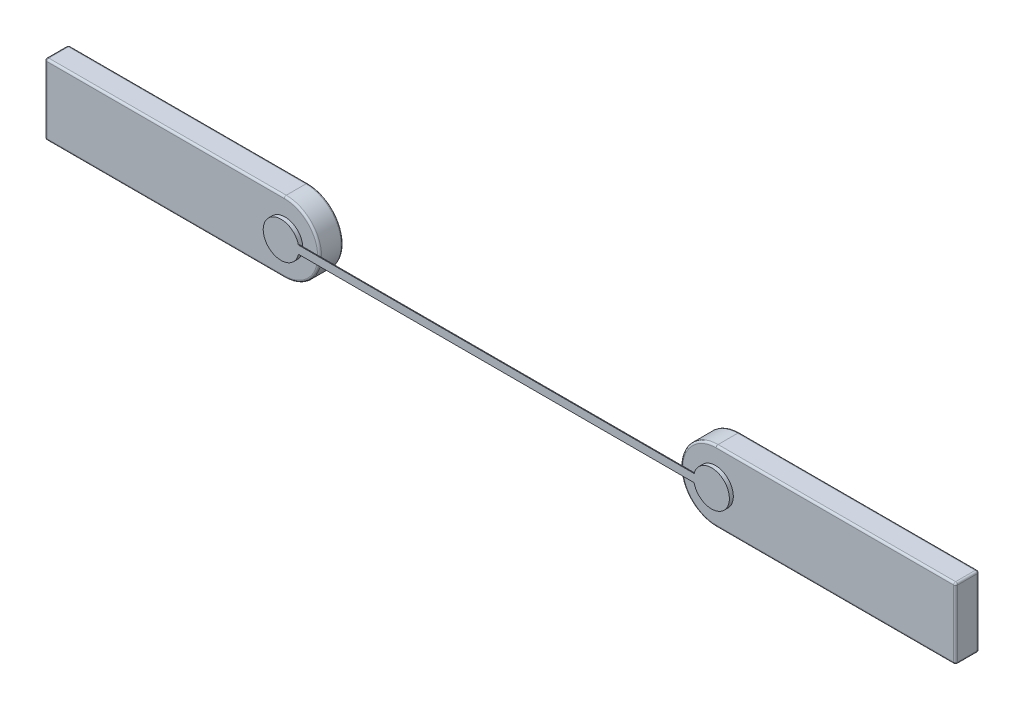
ISO-10303-21;
HEADER;
FILE_DESCRIPTION(('STEP AP214'),'2;1');
FILE_NAME('part.step','',(''),(''),'','','');
FILE_SCHEMA(('AUTOMOTIVE_DESIGN { 1 0 10303 214 1 1 1 1 }'));
ENDSEC;
DATA;
#1=APPLICATION_CONTEXT('core data for automotive mechanical design processes');
#2=APPLICATION_PROTOCOL_DEFINITION('international standard','automotive_design',2000,#1);
#3=PRODUCT_CONTEXT('',#1,'mechanical');
#4=PRODUCT('Part','Part','',(#3));
#5=PRODUCT_RELATED_PRODUCT_CATEGORY('part','',(#4));
#6=PRODUCT_DEFINITION_FORMATION('','',#4);
#7=PRODUCT_DEFINITION_CONTEXT('part definition',#1,'design');
#8=PRODUCT_DEFINITION('design','',#6,#7);
#9=PRODUCT_DEFINITION_SHAPE('','',#8);
#10=(LENGTH_UNIT() NAMED_UNIT(*) SI_UNIT(.MILLI.,.METRE.));
#11=(NAMED_UNIT(*) PLANE_ANGLE_UNIT() SI_UNIT($,.RADIAN.));
#12=(NAMED_UNIT(*) SI_UNIT($,.STERADIAN.) SOLID_ANGLE_UNIT());
#13=UNCERTAINTY_MEASURE_WITH_UNIT(LENGTH_MEASURE(1.E-05),#10,'distance_accuracy_value','');
#14=(GEOMETRIC_REPRESENTATION_CONTEXT(3) GLOBAL_UNCERTAINTY_ASSIGNED_CONTEXT((#13)) GLOBAL_UNIT_ASSIGNED_CONTEXT((#10,
#11,#12)) REPRESENTATION_CONTEXT('',''));
#15=CARTESIAN_POINT('',(0.,0.,0.));
#16=DIRECTION('',(0.,0.,1.));
#17=DIRECTION('',(1.,0.,0.));
#18=AXIS2_PLACEMENT_3D('',#15,#16,#17);
#19=CARTESIAN_POINT('',(-5.775,0.425,0.025));
#20=DIRECTION('',(1.,0.,0.));
#21=DIRECTION('',(0.,0.,-1.));
#22=AXIS2_PLACEMENT_3D('',#19,#20,#21);
#23=SPHERICAL_SURFACE('',#22,0.0249999999999995);
#24=CARTESIAN_POINT('',(-5.775,0.425,0.025));
#25=DIRECTION('',(-1.,0.,0.));
#26=DIRECTION('',(0.,-1.,0.));
#27=AXIS2_PLACEMENT_3D('',#24,#25,#26);
#28=CIRCLE('',#27,0.025);
#29=CARTESIAN_POINT('',(-5.775,0.425,0.));
#30=VERTEX_POINT('',#29);
#31=CARTESIAN_POINT('',(-5.775,0.45,0.025));
#32=VERTEX_POINT('',#31);
#33=EDGE_CURVE('E109',#30,#32,#28,.F.);
#34=ORIENTED_EDGE('',*,*,#33,.F.);
#35=CARTESIAN_POINT('',(-5.775,0.425,0.025));
#36=DIRECTION('',(0.,-1.,0.));
#37=DIRECTION('',(0.,0.,-1.));
#38=AXIS2_PLACEMENT_3D('',#35,#36,#37);
#39=CIRCLE('',#38,0.025);
#40=CARTESIAN_POINT('',(-5.8,0.425,0.025));
#41=VERTEX_POINT('',#40);
#42=EDGE_CURVE('E113',#41,#30,#39,.T.);
#43=ORIENTED_EDGE('',*,*,#42,.F.);
#44=CARTESIAN_POINT('',(-5.775,0.425,0.025));
#45=DIRECTION('',(0.,0.,-1.));
#46=DIRECTION('',(-1.,0.,0.));
#47=AXIS2_PLACEMENT_3D('',#44,#45,#46);
#48=CIRCLE('',#47,0.025);
#49=EDGE_CURVE('E137',#32,#41,#48,.F.);
#50=ORIENTED_EDGE('',*,*,#49,.F.);
#51=EDGE_LOOP('',(#34,#43,#50));
#52=FACE_BOUND('',#51,.T.);
#53=ADVANCED_FACE('F17',(#52),#23,.T.);
#54=CARTESIAN_POINT('',(-5.775,-0.425,0.025));
#55=DIRECTION('',(1.,0.,0.));
#56=DIRECTION('',(0.,-1.,0.));
#57=AXIS2_PLACEMENT_3D('',#54,#55,#56);
#58=SPHERICAL_SURFACE('',#57,0.0249999999999995);
#59=CARTESIAN_POINT('',(-5.775,-0.425,0.025));
#60=DIRECTION('',(0.,-1.,0.));
#61=DIRECTION('',(0.,0.,-1.));
#62=AXIS2_PLACEMENT_3D('',#59,#60,#61);
#63=CIRCLE('',#62,0.025);
#64=CARTESIAN_POINT('',(-5.775,-0.425,0.));
#65=VERTEX_POINT('',#64);
#66=CARTESIAN_POINT('',(-5.8,-0.425,0.025));
#67=VERTEX_POINT('',#66);
#68=EDGE_CURVE('E124',#65,#67,#63,.F.);
#69=ORIENTED_EDGE('',*,*,#68,.F.);
#70=CARTESIAN_POINT('',(-5.775,-0.425,0.025));
#71=DIRECTION('',(1.,0.,0.));
#72=DIRECTION('',(0.,1.,0.));
#73=AXIS2_PLACEMENT_3D('',#70,#71,#72);
#74=CIRCLE('',#73,0.025);
#75=CARTESIAN_POINT('',(-5.775,-0.45,0.025));
#76=VERTEX_POINT('',#75);
#77=EDGE_CURVE('E157',#76,#65,#74,.T.);
#78=ORIENTED_EDGE('',*,*,#77,.F.);
#79=CARTESIAN_POINT('',(-5.775,-0.425,0.025));
#80=DIRECTION('',(0.,0.,-1.));
#81=DIRECTION('',(-1.,0.,0.));
#82=AXIS2_PLACEMENT_3D('',#79,#80,#81);
#83=CIRCLE('',#82,0.025);
#84=EDGE_CURVE('E305',#67,#76,#83,.F.);
#85=ORIENTED_EDGE('',*,*,#84,.F.);
#86=EDGE_LOOP('',(#69,#78,#85));
#87=FACE_BOUND('',#86,.T.);
#88=ADVANCED_FACE('F746',(#87),#58,.T.);
#89=CARTESIAN_POINT('',(-4.138488794369,0.,0.));
#90=DIRECTION('',(0.,0.,1.));
#91=DIRECTION('',(1.,0.,0.));
#92=AXIS2_PLACEMENT_3D('',#89,#90,#91);
#93=PLANE('',#92);
#94=CARTESIAN_POINT('',(-2.75,0.,0.));
#95=DIRECTION('',(0.,0.,1.));
#96=DIRECTION('',(1.,0.,0.));
#97=AXIS2_PLACEMENT_3D('',#94,#95,#96);
#98=CIRCLE('',#97,0.425);
#99=CARTESIAN_POINT('',(-2.75,-0.425,0.));
#100=VERTEX_POINT('',#99);
#101=CARTESIAN_POINT('',(-2.75,0.425,0.));
#102=VERTEX_POINT('',#101);
#103=EDGE_CURVE('E21',#100,#102,#98,.T.);
#104=ORIENTED_EDGE('',*,*,#103,.F.);
#105=DIRECTION('',(1.,0.,0.));
#106=VECTOR('',#105,1.);
#107=CARTESIAN_POINT('',(-4.206744397185,-0.425,0.));
#108=LINE('',#107,#106);
#109=EDGE_CURVE('E120',#65,#100,#108,.T.);
#110=ORIENTED_EDGE('',*,*,#109,.F.);
#111=DIRECTION('',(0.,-1.,0.));
#112=VECTOR('',#111,1.);
#113=CARTESIAN_POINT('',(-5.775,0.,0.));
#114=LINE('',#113,#112);
#115=EDGE_CURVE('E116',#30,#65,#114,.T.);
#116=ORIENTED_EDGE('',*,*,#115,.F.);
#117=DIRECTION('',(-1.,0.,0.));
#118=VECTOR('',#117,1.);
#119=CARTESIAN_POINT('',(-4.206744397185,0.425,0.));
#120=LINE('',#119,#118);
#121=EDGE_CURVE('E103',#102,#30,#120,.T.);
#122=ORIENTED_EDGE('',*,*,#121,.F.);
#123=EDGE_LOOP('',(#104,#110,#116,#122));
#124=FACE_BOUND('',#123,.T.);
#125=ADVANCED_FACE('F118',(#124),#93,.F.);
#126=CARTESIAN_POINT('',(-2.75,0.,0.025));
#127=DIRECTION('',(0.,0.,1.));
#128=DIRECTION('',(1.,0.,0.));
#129=AXIS2_PLACEMENT_3D('',#126,#127,#128);
#130=TOROIDAL_SURFACE('',#129,0.425,0.025);
#131=ORIENTED_EDGE('',*,*,#103,.T.);
#132=CARTESIAN_POINT('',(-2.75,0.425,0.025));
#133=DIRECTION('',(-1.,0.,0.));
#134=DIRECTION('',(0.,-1.,0.));
#135=AXIS2_PLACEMENT_3D('',#132,#133,#134);
#136=CIRCLE('',#135,0.025);
#137=CARTESIAN_POINT('',(-2.75,0.45,0.025));
#138=VERTEX_POINT('',#137);
#139=EDGE_CURVE('E111',#138,#102,#136,.T.);
#140=ORIENTED_EDGE('',*,*,#139,.F.);
#141=CARTESIAN_POINT('',(-2.75,0.,0.025));
#142=DIRECTION('',(0.,0.,-1.));
#143=DIRECTION('',(-1.,0.,0.));
#144=AXIS2_PLACEMENT_3D('',#141,#142,#143);
#145=CIRCLE('',#144,0.45);
#146=CARTESIAN_POINT('',(-2.75,-0.45,0.025));
#147=VERTEX_POINT('',#146);
#148=EDGE_CURVE('E149',#147,#138,#145,.F.);
#149=ORIENTED_EDGE('',*,*,#148,.F.);
#150=CARTESIAN_POINT('',(-2.75,-0.425,0.025));
#151=DIRECTION('',(1.,0.,0.));
#152=DIRECTION('',(0.,1.,0.));
#153=AXIS2_PLACEMENT_3D('',#150,#151,#152);
#154=CIRCLE('',#153,0.025);
#155=EDGE_CURVE('E153',#100,#147,#154,.F.);
#156=ORIENTED_EDGE('',*,*,#155,.F.);
#157=EDGE_LOOP('',(#131,#140,#149,#156));
#158=FACE_BOUND('',#157,.T.);
#159=ADVANCED_FACE('F743',(#158),#130,.T.);
#160=CARTESIAN_POINT('',(-4.206744397185,0.425,0.025));
#161=DIRECTION('',(-1.,0.,0.));
#162=DIRECTION('',(0.,-1.,0.));
#163=AXIS2_PLACEMENT_3D('',#160,#161,#162);
#164=CYLINDRICAL_SURFACE('',#163,0.025);
#165=ORIENTED_EDGE('',*,*,#139,.T.);
#166=ORIENTED_EDGE('',*,*,#121,.T.);
#167=ORIENTED_EDGE('',*,*,#33,.T.);
#168=DIRECTION('',(-1.,0.,0.));
#169=VECTOR('',#168,1.);
#170=CARTESIAN_POINT('',(-4.275,0.45,0.025));
#171=LINE('',#170,#169);
#172=EDGE_CURVE('E285',#138,#32,#171,.T.);
#173=ORIENTED_EDGE('',*,*,#172,.F.);
#174=EDGE_LOOP('',(#165,#166,#167,#173));
#175=FACE_BOUND('',#174,.T.);
#176=ADVANCED_FACE('F105',(#175),#164,.T.);
#177=CARTESIAN_POINT('',(-5.775,0.,0.025));
#178=DIRECTION('',(0.,-1.,0.));
#179=DIRECTION('',(0.,0.,-1.));
#180=AXIS2_PLACEMENT_3D('',#177,#178,#179);
#181=CYLINDRICAL_SURFACE('',#180,0.025);
#182=ORIENTED_EDGE('',*,*,#68,.T.);
#183=DIRECTION('',(0.,1.,0.));
#184=VECTOR('',#183,1.);
#185=CARTESIAN_POINT('',(-5.8,0.,0.025));
#186=LINE('',#185,#184);
#187=EDGE_CURVE('E131',#41,#67,#186,.F.);
#188=ORIENTED_EDGE('',*,*,#187,.F.);
#189=ORIENTED_EDGE('',*,*,#42,.T.);
#190=ORIENTED_EDGE('',*,*,#115,.T.);
#191=EDGE_LOOP('',(#182,#188,#189,#190));
#192=FACE_BOUND('',#191,.T.);
#193=ADVANCED_FACE('F128',(#192),#181,.T.);
#194=CARTESIAN_POINT('',(-5.775,0.425,0.3));
#195=DIRECTION('',(0.,0.,-1.));
#196=DIRECTION('',(-1.,0.,0.));
#197=AXIS2_PLACEMENT_3D('',#194,#195,#196);
#198=CYLINDRICAL_SURFACE('',#197,0.025);
#199=ORIENTED_EDGE('',*,*,#49,.T.);
#200=DIRECTION('',(0.,0.,1.));
#201=VECTOR('',#200,1.);
#202=CARTESIAN_POINT('',(-5.8,0.425,0.3));
#203=LINE('',#202,#201);
#204=CARTESIAN_POINT('',(-5.8,0.425,0.275));
#205=VERTEX_POINT('',#204);
#206=EDGE_CURVE('E258',#205,#41,#203,.F.);
#207=ORIENTED_EDGE('',*,*,#206,.F.);
#208=CARTESIAN_POINT('',(-5.775,0.425,0.275));
#209=DIRECTION('',(0.,0.,1.));
#210=DIRECTION('',(1.,0.,0.));
#211=AXIS2_PLACEMENT_3D('',#208,#209,#210);
#212=CIRCLE('',#211,0.0249999999999995);
#213=CARTESIAN_POINT('',(-5.775,0.45,0.275));
#214=VERTEX_POINT('',#213);
#215=EDGE_CURVE('E273',#214,#205,#212,.T.);
#216=ORIENTED_EDGE('',*,*,#215,.F.);
#217=DIRECTION('',(0.,0.,1.));
#218=VECTOR('',#217,1.);
#219=CARTESIAN_POINT('',(-5.775,0.45,0.3));
#220=LINE('',#219,#218);
#221=EDGE_CURVE('E276',#32,#214,#220,.T.);
#222=ORIENTED_EDGE('',*,*,#221,.F.);
#223=EDGE_LOOP('',(#199,#207,#216,#222));
#224=FACE_BOUND('',#223,.T.);
#225=ADVANCED_FACE('F735',(#224),#198,.T.);
#226=CARTESIAN_POINT('',(-5.775,-0.425,0.3));
#227=DIRECTION('',(0.,0.,-1.));
#228=DIRECTION('',(-1.,0.,0.));
#229=AXIS2_PLACEMENT_3D('',#226,#227,#228);
#230=CYLINDRICAL_SURFACE('',#229,0.025);
#231=ORIENTED_EDGE('',*,*,#84,.T.);
#232=DIRECTION('',(0.,0.,1.));
#233=VECTOR('',#232,1.);
#234=CARTESIAN_POINT('',(-5.775,-0.45,0.3));
#235=LINE('',#234,#233);
#236=CARTESIAN_POINT('',(-5.775,-0.45,0.275));
#237=VERTEX_POINT('',#236);
#238=EDGE_CURVE('E250',#237,#76,#235,.F.);
#239=ORIENTED_EDGE('',*,*,#238,.F.);
#240=CARTESIAN_POINT('',(-5.775,-0.425,0.275));
#241=DIRECTION('',(0.,0.,1.));
#242=DIRECTION('',(1.,0.,0.));
#243=AXIS2_PLACEMENT_3D('',#240,#241,#242);
#244=CIRCLE('',#243,0.0249999999999995);
#245=CARTESIAN_POINT('',(-5.8,-0.425,0.275));
#246=VERTEX_POINT('',#245);
#247=EDGE_CURVE('E253',#246,#237,#244,.T.);
#248=ORIENTED_EDGE('',*,*,#247,.F.);
#249=DIRECTION('',(0.,0.,1.));
#250=VECTOR('',#249,1.);
#251=CARTESIAN_POINT('',(-5.8,-0.425,0.3));
#252=LINE('',#251,#250);
#253=EDGE_CURVE('E265',#67,#246,#252,.T.);
#254=ORIENTED_EDGE('',*,*,#253,.F.);
#255=EDGE_LOOP('',(#231,#239,#248,#254));
#256=FACE_BOUND('',#255,.T.);
#257=ADVANCED_FACE('F599',(#256),#230,.T.);
#258=CARTESIAN_POINT('',(-4.206744397185,-0.425,0.025));
#259=DIRECTION('',(1.,0.,0.));
#260=DIRECTION('',(0.,1.,0.));
#261=AXIS2_PLACEMENT_3D('',#258,#259,#260);
#262=CYLINDRICAL_SURFACE('',#261,0.025);
#263=ORIENTED_EDGE('',*,*,#155,.T.);
#264=DIRECTION('',(1.,0.,0.));
#265=VECTOR('',#264,1.);
#266=CARTESIAN_POINT('',(-4.275,-0.45,0.025));
#267=LINE('',#266,#265);
#268=EDGE_CURVE('E247',#76,#147,#267,.T.);
#269=ORIENTED_EDGE('',*,*,#268,.F.);
#270=ORIENTED_EDGE('',*,*,#77,.T.);
#271=ORIENTED_EDGE('',*,*,#109,.T.);
#272=EDGE_LOOP('',(#263,#269,#270,#271));
#273=FACE_BOUND('',#272,.T.);
#274=ADVANCED_FACE('F729',(#273),#262,.T.);
#275=CARTESIAN_POINT('',(-2.75,0.,0.3));
#276=DIRECTION('',(0.,0.,-1.));
#277=DIRECTION('',(-1.,0.,0.));
#278=AXIS2_PLACEMENT_3D('',#275,#276,#277);
#279=CYLINDRICAL_SURFACE('',#278,0.45);
#280=DIRECTION('',(0.,0.,1.));
#281=VECTOR('',#280,1.);
#282=CARTESIAN_POINT('',(-2.75,0.45,0.3));
#283=LINE('',#282,#281);
#284=CARTESIAN_POINT('',(-2.75,0.45,0.275));
#285=VERTEX_POINT('',#284);
#286=EDGE_CURVE('E152',#285,#138,#283,.F.);
#287=ORIENTED_EDGE('',*,*,#286,.F.);
#288=CARTESIAN_POINT('',(-2.75,0.,0.275));
#289=DIRECTION('',(0.,0.,1.));
#290=DIRECTION('',(1.,0.,0.));
#291=AXIS2_PLACEMENT_3D('',#288,#289,#290);
#292=CIRCLE('',#291,0.45);
#293=CARTESIAN_POINT('',(-2.75,-0.45,0.275));
#294=VERTEX_POINT('',#293);
#295=EDGE_CURVE('E239',#294,#285,#292,.T.);
#296=ORIENTED_EDGE('',*,*,#295,.F.);
#297=DIRECTION('',(0.,0.,1.));
#298=VECTOR('',#297,1.);
#299=CARTESIAN_POINT('',(-2.75,-0.45,0.3));
#300=LINE('',#299,#298);
#301=EDGE_CURVE('E244',#147,#294,#300,.T.);
#302=ORIENTED_EDGE('',*,*,#301,.F.);
#303=ORIENTED_EDGE('',*,*,#148,.T.);
#304=EDGE_LOOP('',(#287,#296,#302,#303));
#305=FACE_BOUND('',#304,.T.);
#306=ADVANCED_FACE('F606',(#305),#279,.T.);
#307=CARTESIAN_POINT('',(-4.275,0.45,0.3));
#308=DIRECTION('',(0.,1.,0.));
#309=DIRECTION('',(-1.,0.,0.));
#310=AXIS2_PLACEMENT_3D('',#307,#308,#309);
#311=PLANE('',#310);
#312=ORIENTED_EDGE('',*,*,#172,.T.);
#313=ORIENTED_EDGE('',*,*,#221,.T.);
#314=DIRECTION('',(-1.,0.,0.));
#315=VECTOR('',#314,1.);
#316=CARTESIAN_POINT('',(-4.206744397185,0.45,0.275));
#317=LINE('',#316,#315);
#318=EDGE_CURVE('E228',#285,#214,#317,.T.);
#319=ORIENTED_EDGE('',*,*,#318,.F.);
#320=ORIENTED_EDGE('',*,*,#286,.T.);
#321=EDGE_LOOP('',(#312,#313,#319,#320));
#322=FACE_BOUND('',#321,.T.);
#323=ADVANCED_FACE('F323',(#322),#311,.T.);
#324=CARTESIAN_POINT('',(-5.775,0.425,0.275));
#325=DIRECTION('',(1.,0.,0.));
#326=DIRECTION('',(0.,1.,0.));
#327=AXIS2_PLACEMENT_3D('',#324,#325,#326);
#328=SPHERICAL_SURFACE('',#327,0.0249999999999995);
#329=ORIENTED_EDGE('',*,*,#215,.T.);
#330=CARTESIAN_POINT('',(-5.775,0.425,0.275));
#331=DIRECTION('',(0.,-1.,0.));
#332=DIRECTION('',(0.,0.,-1.));
#333=AXIS2_PLACEMENT_3D('',#330,#331,#332);
#334=CIRCLE('',#333,0.025);
#335=CARTESIAN_POINT('',(-5.775,0.425,0.3));
#336=VERTEX_POINT('',#335);
#337=EDGE_CURVE('E225',#336,#205,#334,.T.);
#338=ORIENTED_EDGE('',*,*,#337,.F.);
#339=CARTESIAN_POINT('',(-5.775,0.425,0.275));
#340=DIRECTION('',(-1.,0.,0.));
#341=DIRECTION('',(0.,-1.,0.));
#342=AXIS2_PLACEMENT_3D('',#339,#340,#341);
#343=CIRCLE('',#342,0.025);
#344=EDGE_CURVE('E234',#214,#336,#343,.F.);
#345=ORIENTED_EDGE('',*,*,#344,.F.);
#346=EDGE_LOOP('',(#329,#338,#345));
#347=FACE_BOUND('',#346,.T.);
#348=ADVANCED_FACE('F615',(#347),#328,.T.);
#349=CARTESIAN_POINT('',(-5.8,0.,0.3));
#350=DIRECTION('',(-1.,0.,0.));
#351=DIRECTION('',(0.,0.,1.));
#352=AXIS2_PLACEMENT_3D('',#349,#350,#351);
#353=PLANE('',#352);
#354=DIRECTION('',(0.,-1.,0.));
#355=VECTOR('',#354,1.);
#356=CARTESIAN_POINT('',(-5.8,0.,0.275));
#357=LINE('',#356,#355);
#358=EDGE_CURVE('E222',#205,#246,#357,.T.);
#359=ORIENTED_EDGE('',*,*,#358,.F.);
#360=ORIENTED_EDGE('',*,*,#206,.T.);
#361=ORIENTED_EDGE('',*,*,#187,.T.);
#362=ORIENTED_EDGE('',*,*,#253,.T.);
#363=EDGE_LOOP('',(#359,#360,#361,#362));
#364=FACE_BOUND('',#363,.T.);
#365=ADVANCED_FACE('F622',(#364),#353,.T.);
#366=CARTESIAN_POINT('',(-5.775,-0.425,0.275));
#367=DIRECTION('',(1.,0.,0.));
#368=DIRECTION('',(0.,0.,1.));
#369=AXIS2_PLACEMENT_3D('',#366,#367,#368);
#370=SPHERICAL_SURFACE('',#369,0.0249999999999995);
#371=ORIENTED_EDGE('',*,*,#247,.T.);
#372=CARTESIAN_POINT('',(-5.775,-0.425,0.275));
#373=DIRECTION('',(1.,0.,0.));
#374=DIRECTION('',(0.,1.,0.));
#375=AXIS2_PLACEMENT_3D('',#372,#373,#374);
#376=CIRCLE('',#375,0.025);
#377=CARTESIAN_POINT('',(-5.775,-0.425,0.3));
#378=VERTEX_POINT('',#377);
#379=EDGE_CURVE('E204',#378,#237,#376,.T.);
#380=ORIENTED_EDGE('',*,*,#379,.F.);
#381=CARTESIAN_POINT('',(-5.775,-0.425,0.275));
#382=DIRECTION('',(0.,-1.,0.));
#383=DIRECTION('',(0.,0.,-1.));
#384=AXIS2_PLACEMENT_3D('',#381,#382,#383);
#385=CIRCLE('',#384,0.025);
#386=EDGE_CURVE('E213',#246,#378,#385,.F.);
#387=ORIENTED_EDGE('',*,*,#386,.F.);
#388=EDGE_LOOP('',(#371,#380,#387));
#389=FACE_BOUND('',#388,.T.);
#390=ADVANCED_FACE('F620',(#389),#370,.T.);
#391=CARTESIAN_POINT('',(-4.275,-0.45,0.3));
#392=DIRECTION('',(0.,-1.,0.));
#393=DIRECTION('',(1.,0.,0.));
#394=AXIS2_PLACEMENT_3D('',#391,#392,#393);
#395=PLANE('',#394);
#396=ORIENTED_EDGE('',*,*,#268,.T.);
#397=ORIENTED_EDGE('',*,*,#301,.T.);
#398=DIRECTION('',(1.,0.,0.));
#399=VECTOR('',#398,1.);
#400=CARTESIAN_POINT('',(-4.206744397185,-0.45,0.275));
#401=LINE('',#400,#399);
#402=EDGE_CURVE('E198',#237,#294,#401,.T.);
#403=ORIENTED_EDGE('',*,*,#402,.F.);
#404=ORIENTED_EDGE('',*,*,#238,.T.);
#405=EDGE_LOOP('',(#396,#397,#403,#404));
#406=FACE_BOUND('',#405,.T.);
#407=ADVANCED_FACE('F604',(#406),#395,.T.);
#408=CARTESIAN_POINT('',(-2.75,0.,0.275));
#409=DIRECTION('',(0.,0.,-1.));
#410=DIRECTION('',(-1.,0.,0.));
#411=AXIS2_PLACEMENT_3D('',#408,#409,#410);
#412=TOROIDAL_SURFACE('',#411,0.425,0.0250000000000001);
#413=CARTESIAN_POINT('',(-2.75,0.425,0.275));
#414=DIRECTION('',(-1.,0.,0.));
#415=DIRECTION('',(0.,-1.,0.));
#416=AXIS2_PLACEMENT_3D('',#413,#414,#415);
#417=CIRCLE('',#416,0.025);
#418=CARTESIAN_POINT('',(-2.75,0.425,0.3));
#419=VERTEX_POINT('',#418);
#420=EDGE_CURVE('E231',#419,#285,#417,.T.);
#421=ORIENTED_EDGE('',*,*,#420,.F.);
#422=CARTESIAN_POINT('',(-2.75,0.,0.3));
#423=DIRECTION('',(0.,0.,-1.));
#424=DIRECTION('',(-1.,0.,0.));
#425=AXIS2_PLACEMENT_3D('',#422,#423,#424);
#426=CIRCLE('',#425,0.425);
#427=CARTESIAN_POINT('',(-2.75,-0.425,0.3));
#428=VERTEX_POINT('',#427);
#429=EDGE_CURVE('E188',#428,#419,#426,.F.);
#430=ORIENTED_EDGE('',*,*,#429,.F.);
#431=CARTESIAN_POINT('',(-2.75,-0.425,0.275));
#432=DIRECTION('',(1.,0.,0.));
#433=DIRECTION('',(0.,1.,0.));
#434=AXIS2_PLACEMENT_3D('',#431,#432,#433);
#435=CIRCLE('',#434,0.025);
#436=EDGE_CURVE('E190',#294,#428,#435,.F.);
#437=ORIENTED_EDGE('',*,*,#436,.F.);
#438=ORIENTED_EDGE('',*,*,#295,.T.);
#439=EDGE_LOOP('',(#421,#430,#437,#438));
#440=FACE_BOUND('',#439,.T.);
#441=ADVANCED_FACE('F608',(#440),#412,.T.);
#442=CARTESIAN_POINT('',(-4.206744397185,0.425,0.275));
#443=DIRECTION('',(-1.,0.,0.));
#444=DIRECTION('',(0.,-1.,0.));
#445=AXIS2_PLACEMENT_3D('',#442,#443,#444);
#446=CYLINDRICAL_SURFACE('',#445,0.025);
#447=ORIENTED_EDGE('',*,*,#420,.T.);
#448=ORIENTED_EDGE('',*,*,#318,.T.);
#449=ORIENTED_EDGE('',*,*,#344,.T.);
#450=DIRECTION('',(1.,0.,0.));
#451=VECTOR('',#450,1.);
#452=CARTESIAN_POINT('',(-4.138488794369,0.425,0.3));
#453=LINE('',#452,#451);
#454=EDGE_CURVE('E189',#419,#336,#453,.F.);
#455=ORIENTED_EDGE('',*,*,#454,.F.);
#456=EDGE_LOOP('',(#447,#448,#449,#455));
#457=FACE_BOUND('',#456,.T.);
#458=ADVANCED_FACE('F611',(#457),#446,.T.);
#459=CARTESIAN_POINT('',(-5.775,0.,0.275));
#460=DIRECTION('',(0.,-1.,0.));
#461=DIRECTION('',(0.,0.,-1.));
#462=AXIS2_PLACEMENT_3D('',#459,#460,#461);
#463=CYLINDRICAL_SURFACE('',#462,0.025);
#464=ORIENTED_EDGE('',*,*,#386,.T.);
#465=DIRECTION('',(0.,1.,0.));
#466=VECTOR('',#465,1.);
#467=CARTESIAN_POINT('',(-5.775,0.,0.3));
#468=LINE('',#467,#466);
#469=EDGE_CURVE('E195',#336,#378,#468,.F.);
#470=ORIENTED_EDGE('',*,*,#469,.F.);
#471=ORIENTED_EDGE('',*,*,#337,.T.);
#472=ORIENTED_EDGE('',*,*,#358,.T.);
#473=EDGE_LOOP('',(#464,#470,#471,#472));
#474=FACE_BOUND('',#473,.T.);
#475=ADVANCED_FACE('F618',(#474),#463,.T.);
#476=CARTESIAN_POINT('',(-4.206744397185,-0.425,0.275));
#477=DIRECTION('',(1.,0.,0.));
#478=DIRECTION('',(0.,1.,0.));
#479=AXIS2_PLACEMENT_3D('',#476,#477,#478);
#480=CYLINDRICAL_SURFACE('',#479,0.025);
#481=ORIENTED_EDGE('',*,*,#436,.T.);
#482=DIRECTION('',(1.,0.,0.));
#483=VECTOR('',#482,1.);
#484=CARTESIAN_POINT('',(-4.138488794369,-0.425,0.3));
#485=LINE('',#484,#483);
#486=EDGE_CURVE('E187',#378,#428,#485,.T.);
#487=ORIENTED_EDGE('',*,*,#486,.F.);
#488=ORIENTED_EDGE('',*,*,#379,.T.);
#489=ORIENTED_EDGE('',*,*,#402,.T.);
#490=EDGE_LOOP('',(#481,#487,#488,#489));
#491=FACE_BOUND('',#490,.T.);
#492=ADVANCED_FACE('F592',(#491),#480,.T.);
#493=CARTESIAN_POINT('',(-4.138488794369,0.,0.3));
#494=DIRECTION('',(0.,0.,1.));
#495=DIRECTION('',(1.,0.,0.));
#496=AXIS2_PLACEMENT_3D('',#493,#494,#495);
#497=PLANE('',#496);
#498=CARTESIAN_POINT('',(-2.741543054581,0.,0.3));
#499=DIRECTION('',(0.,0.,1.));
#500=DIRECTION('',(0.,-1.,0.));
#501=AXIS2_PLACEMENT_3D('',#498,#499,#500);
#502=CIRCLE('',#501,0.227268223013);
#503=CARTESIAN_POINT('',(-2.741543054581,-0.227268223013,0.3));
#504=VERTEX_POINT('',#503);
#505=EDGE_CURVE('E180',#504,#504,#502,.T.);
#506=ORIENTED_EDGE('',*,*,#505,.F.);
#507=EDGE_LOOP('',(#506));
#508=FACE_BOUND('',#507,.T.);
#509=ORIENTED_EDGE('',*,*,#469,.T.);
#510=ORIENTED_EDGE('',*,*,#486,.T.);
#511=ORIENTED_EDGE('',*,*,#429,.T.);
#512=ORIENTED_EDGE('',*,*,#454,.T.);
#513=EDGE_LOOP('',(#509,#510,#511,#512));
#514=FACE_BOUND('',#513,.T.);
#515=ADVANCED_FACE('F589',(#508,#514),#497,.T.);
#516=CARTESIAN_POINT('',(-0.001545764647756,0.002306967392937,0.34));
#517=DIRECTION('',(0.,0.,1.));
#518=DIRECTION('',(1.,0.,0.));
#519=AXIS2_PLACEMENT_3D('',#516,#517,#518);
#520=PLANE('',#519);
#521=CARTESIAN_POINT('',(2.741543054581,0.,0.34));
#522=DIRECTION('',(0.,0.,1.));
#523=DIRECTION('',(0.,-1.,0.));
#524=AXIS2_PLACEMENT_3D('',#521,#522,#523);
#525=CIRCLE('',#524,0.227268223013);
#526=CARTESIAN_POINT('',(2.51948042294408,-0.04836354848442,0.34));
#527=VERTEX_POINT('',#526);
#528=CARTESIAN_POINT('',(2.52053574371118,0.05297748327029,0.34));
#529=VERTEX_POINT('',#528);
#530=EDGE_CURVE('E184',#527,#529,#525,.F.);
#531=ORIENTED_EDGE('',*,*,#530,.F.);
#532=DIRECTION('',(1.,0.,0.));
#533=VECTOR('',#532,1.);
#534=CARTESIAN_POINT('',(-0.001545764647756,-0.04836354848442,0.34));
#535=LINE('',#534,#533);
#536=CARTESIAN_POINT('',(-2.51948042294408,-0.04836354848442,0.34));
#537=VERTEX_POINT('',#536);
#538=EDGE_CURVE('E575',#537,#527,#535,.T.);
#539=ORIENTED_EDGE('',*,*,#538,.F.);
#540=CARTESIAN_POINT('',(-2.741543054581,0.,0.34));
#541=DIRECTION('',(0.,0.,1.));
#542=DIRECTION('',(0.,-1.,0.));
#543=AXIS2_PLACEMENT_3D('',#540,#541,#542);
#544=CIRCLE('',#543,0.227268223013);
#545=CARTESIAN_POINT('',(-2.52053574371134,0.05297748327025,0.34));
#546=VERTEX_POINT('',#545);
#547=EDGE_CURVE('E176',#546,#537,#544,.F.);
#548=ORIENTED_EDGE('',*,*,#547,.F.);
#549=DIRECTION('',(1.,0.,0.));
#550=VECTOR('',#549,1.);
#551=CARTESIAN_POINT('',(-0.001545764647756,0.05297748327029,0.34));
#552=LINE('',#551,#550);
#553=EDGE_CURVE('E183',#529,#546,#552,.F.);
#554=ORIENTED_EDGE('',*,*,#553,.F.);
#555=EDGE_LOOP('',(#531,#539,#548,#554));
#556=FACE_BOUND('',#555,.T.);
#557=ADVANCED_FACE('F711',(#556),#520,.F.);
#558=CARTESIAN_POINT('',(-0.001545764647756,0.05297748327029,0.35));
#559=DIRECTION('',(0.,1.,0.));
#560=DIRECTION('',(0.,0.,1.));
#561=AXIS2_PLACEMENT_3D('',#558,#559,#560);
#562=PLANE('',#561);
#563=DIRECTION('',(0.,0.,1.));
#564=VECTOR('',#563,1.);
#565=CARTESIAN_POINT('',(-2.52053574371133,0.0529774832702101,0.3));
#566=LINE('',#565,#564);
#567=CARTESIAN_POINT('',(-2.52053574371134,0.05297748327025,0.35));
#568=VERTEX_POINT('',#567);
#569=EDGE_CURVE('E179',#568,#546,#566,.F.);
#570=ORIENTED_EDGE('',*,*,#569,.F.);
#571=DIRECTION('',(1.,0.,0.));
#572=VECTOR('',#571,1.);
#573=CARTESIAN_POINT('',(-2.741543054581,0.05297748327029,0.35));
#574=LINE('',#573,#572);
#575=CARTESIAN_POINT('',(2.52053574371118,0.05297748327029,0.35));
#576=VERTEX_POINT('',#575);
#577=EDGE_CURVE('E175',#576,#568,#574,.F.);
#578=ORIENTED_EDGE('',*,*,#577,.F.);
#579=DIRECTION('',(0.,0.,1.));
#580=VECTOR('',#579,1.);
#581=CARTESIAN_POINT('',(2.520535743711,0.05297748327029,0.35));
#582=LINE('',#581,#580);
#583=EDGE_CURVE('E186',#576,#529,#582,.F.);
#584=ORIENTED_EDGE('',*,*,#583,.T.);
#585=ORIENTED_EDGE('',*,*,#553,.T.);
#586=EDGE_LOOP('',(#570,#578,#584,#585));
#587=FACE_BOUND('',#586,.T.);
#588=ADVANCED_FACE('F707',(#587),#562,.T.);
#589=CARTESIAN_POINT('',(-2.741543054581,0.,0.3));
#590=DIRECTION('',(0.,0.,1.));
#591=DIRECTION('',(0.,-1.,0.));
#592=AXIS2_PLACEMENT_3D('',#589,#590,#591);
#593=CYLINDRICAL_SURFACE('',#592,0.227268223013);
#594=CARTESIAN_POINT('',(-2.741543054581,0.,0.35));
#595=DIRECTION('',(0.,0.,1.));
#596=DIRECTION('',(0.,-1.,0.));
#597=AXIS2_PLACEMENT_3D('',#594,#595,#596);
#598=CIRCLE('',#597,0.227268223013);
#599=CARTESIAN_POINT('',(-2.51948042294408,-0.04836354848442,0.35));
#600=VERTEX_POINT('',#599);
#601=EDGE_CURVE('E173',#568,#600,#598,.T.);
#602=ORIENTED_EDGE('',*,*,#601,.F.);
#603=ORIENTED_EDGE('',*,*,#569,.T.);
#604=ORIENTED_EDGE('',*,*,#547,.T.);
#605=DIRECTION('',(0.,0.,-1.));
#606=VECTOR('',#605,1.);
#607=CARTESIAN_POINT('',(-2.519480422944,-0.04836354848442,0.35));
#608=LINE('',#607,#606);
#609=EDGE_CURVE('E576',#600,#537,#608,.T.);
#610=ORIENTED_EDGE('',*,*,#609,.F.);
#611=EDGE_LOOP('',(#602,#603,#604,#610));
#612=FACE_BOUND('',#611,.T.);
#613=ORIENTED_EDGE('',*,*,#505,.T.);
#614=EDGE_LOOP('',(#613));
#615=FACE_BOUND('',#614,.T.);
#616=ADVANCED_FACE('F703',(#612,#615),#593,.T.);
#617=CARTESIAN_POINT('',(-0.001545764647756,-0.04836354848442,0.35));
#618=DIRECTION('',(0.,-1.,0.));
#619=DIRECTION('',(0.,0.,-1.));
#620=AXIS2_PLACEMENT_3D('',#617,#618,#619);
#621=PLANE('',#620);
#622=ORIENTED_EDGE('',*,*,#609,.T.);
#623=ORIENTED_EDGE('',*,*,#538,.T.);
#624=DIRECTION('',(0.,0.,-1.));
#625=VECTOR('',#624,1.);
#626=CARTESIAN_POINT('',(2.519480422944,-0.04836354848442,0.35));
#627=LINE('',#626,#625);
#628=CARTESIAN_POINT('',(2.51948042294408,-0.04836354848442,0.35));
#629=VERTEX_POINT('',#628);
#630=EDGE_CURVE('E178',#527,#629,#627,.F.);
#631=ORIENTED_EDGE('',*,*,#630,.T.);
#632=DIRECTION('',(1.,0.,0.));
#633=VECTOR('',#632,1.);
#634=CARTESIAN_POINT('',(-2.741543054581,-0.04836354848442,0.35));
#635=LINE('',#634,#633);
#636=EDGE_CURVE('E172',#600,#629,#635,.T.);
#637=ORIENTED_EDGE('',*,*,#636,.F.);
#638=EDGE_LOOP('',(#622,#623,#631,#637));
#639=FACE_BOUND('',#638,.T.);
#640=ADVANCED_FACE('F699',(#639),#621,.T.);
#641=CARTESIAN_POINT('',(-2.741543054581,0.,0.35));
#642=DIRECTION('',(0.,0.,1.));
#643=DIRECTION('',(1.,0.,0.));
#644=AXIS2_PLACEMENT_3D('',#641,#642,#643);
#645=PLANE('',#644);
#646=ORIENTED_EDGE('',*,*,#636,.T.);
#647=CARTESIAN_POINT('',(2.741543054581,0.,0.35));
#648=DIRECTION('',(0.,0.,1.));
#649=DIRECTION('',(0.,-1.,0.));
#650=AXIS2_PLACEMENT_3D('',#647,#648,#649);
#651=CIRCLE('',#650,0.227268223013);
#652=EDGE_CURVE('E170',#576,#629,#651,.F.);
#653=ORIENTED_EDGE('',*,*,#652,.F.);
#654=ORIENTED_EDGE('',*,*,#577,.T.);
#655=ORIENTED_EDGE('',*,*,#601,.T.);
#656=EDGE_LOOP('',(#646,#653,#654,#655));
#657=FACE_BOUND('',#656,.T.);
#658=ADVANCED_FACE('F695',(#657),#645,.T.);
#659=CARTESIAN_POINT('',(2.741543054581,0.,0.3));
#660=DIRECTION('',(0.,0.,1.));
#661=DIRECTION('',(0.,-1.,0.));
#662=AXIS2_PLACEMENT_3D('',#659,#660,#661);
#663=CYLINDRICAL_SURFACE('',#662,0.227268223013);
#664=ORIENTED_EDGE('',*,*,#583,.F.);
#665=ORIENTED_EDGE('',*,*,#652,.T.);
#666=ORIENTED_EDGE('',*,*,#630,.F.);
#667=ORIENTED_EDGE('',*,*,#530,.T.);
#668=EDGE_LOOP('',(#664,#665,#666,#667));
#669=FACE_BOUND('',#668,.T.);
#670=CARTESIAN_POINT('',(2.741543054581,0.,0.3));
#671=DIRECTION('',(0.,0.,1.));
#672=DIRECTION('',(0.,-1.,0.));
#673=AXIS2_PLACEMENT_3D('',#670,#671,#672);
#674=CIRCLE('',#673,0.227268223013);
#675=CARTESIAN_POINT('',(2.741543054581,-0.227268223013,0.3));
#676=VERTEX_POINT('',#675);
#677=EDGE_CURVE('E164',#676,#676,#674,.F.);
#678=ORIENTED_EDGE('',*,*,#677,.F.);
#679=EDGE_LOOP('',(#678));
#680=FACE_BOUND('',#679,.T.);
#681=ADVANCED_FACE('F692',(#669,#680),#663,.T.);
#682=CARTESIAN_POINT('',(5.775,-0.425,0.275));
#683=DIRECTION('',(1.,1.01107093609524E-13,-1.01107093609525E-13));
#684=DIRECTION('',(1.01107093609525E-13,0.,1.));
#685=AXIS2_PLACEMENT_3D('',#682,#683,#684);
#686=SPHERICAL_SURFACE('',#685,0.0249999999999995);
#687=CARTESIAN_POINT('',(5.775,-0.425,0.275));
#688=DIRECTION('',(-1.,0.,0.));
#689=DIRECTION('',(0.,-1.,0.));
#690=AXIS2_PLACEMENT_3D('',#687,#688,#689);
#691=CIRCLE('',#690,0.025);
#692=CARTESIAN_POINT('',(5.775,-0.45,0.275));
#693=VERTEX_POINT('',#692);
#694=CARTESIAN_POINT('',(5.775,-0.425000000000048,0.3));
#695=VERTEX_POINT('',#694);
#696=EDGE_CURVE('E167',#693,#695,#691,.T.);
#697=ORIENTED_EDGE('',*,*,#696,.F.);
#698=CARTESIAN_POINT('',(5.775,-0.425,0.275));
#699=DIRECTION('',(0.,0.,-1.));
#700=DIRECTION('',(-1.,0.,0.));
#701=AXIS2_PLACEMENT_3D('',#698,#699,#700);
#702=CIRCLE('',#701,0.025);
#703=CARTESIAN_POINT('',(5.8,-0.425,0.275));
#704=VERTEX_POINT('',#703);
#705=EDGE_CURVE('E536',#704,#693,#702,.T.);
#706=ORIENTED_EDGE('',*,*,#705,.F.);
#707=CARTESIAN_POINT('',(5.775,-0.425,0.275));
#708=DIRECTION('',(0.,-1.,0.));
#709=DIRECTION('',(0.,0.,-1.));
#710=AXIS2_PLACEMENT_3D('',#707,#708,#709);
#711=CIRCLE('',#710,0.025);
#712=EDGE_CURVE('E540',#695,#704,#711,.F.);
#713=ORIENTED_EDGE('',*,*,#712,.F.);
#714=EDGE_LOOP('',(#697,#706,#713));
#715=FACE_BOUND('',#714,.T.);
#716=ADVANCED_FACE('F690',(#715),#686,.T.);
#717=CARTESIAN_POINT('',(4.138488794369,0.,0.3));
#718=DIRECTION('',(0.,0.,1.));
#719=DIRECTION('',(0.,-1.,0.));
#720=AXIS2_PLACEMENT_3D('',#717,#718,#719);
#721=PLANE('',#720);
#722=ORIENTED_EDGE('',*,*,#677,.T.);
#723=EDGE_LOOP('',(#722));
#724=FACE_BOUND('',#723,.T.);
#725=DIRECTION('',(1.,0.,0.));
#726=VECTOR('',#725,1.);
#727=CARTESIAN_POINT('',(4.206744397185,0.425,0.3));
#728=LINE('',#727,#726);
#729=CARTESIAN_POINT('',(2.75,0.425,0.3));
#730=VERTEX_POINT('',#729);
#731=CARTESIAN_POINT('',(5.775,0.425,0.3));
#732=VERTEX_POINT('',#731);
#733=EDGE_CURVE('E531',#730,#732,#728,.T.);
#734=ORIENTED_EDGE('',*,*,#733,.F.);
#735=CARTESIAN_POINT('',(2.75,0.,0.3));
#736=DIRECTION('',(0.,0.,-1.));
#737=DIRECTION('',(-1.,0.,0.));
#738=AXIS2_PLACEMENT_3D('',#735,#736,#737);
#739=CIRCLE('',#738,0.425);
#740=CARTESIAN_POINT('',(2.75,-0.425,0.3));
#741=VERTEX_POINT('',#740);
#742=EDGE_CURVE('E168',#730,#741,#739,.F.);
#743=ORIENTED_EDGE('',*,*,#742,.T.);
#744=DIRECTION('',(-1.,0.,0.));
#745=VECTOR('',#744,1.);
#746=CARTESIAN_POINT('',(4.206744397185,-0.425,0.3));
#747=LINE('',#746,#745);
#748=EDGE_CURVE('E553',#695,#741,#747,.T.);
#749=ORIENTED_EDGE('',*,*,#748,.F.);
#750=DIRECTION('',(0.,-1.,0.));
#751=VECTOR('',#750,1.);
#752=CARTESIAN_POINT('',(5.775,0.,0.3));
#753=LINE('',#752,#751);
#754=EDGE_CURVE('E548',#732,#695,#753,.T.);
#755=ORIENTED_EDGE('',*,*,#754,.F.);
#756=EDGE_LOOP('',(#734,#743,#749,#755));
#757=FACE_BOUND('',#756,.T.);
#758=ADVANCED_FACE('F687',(#724,#757),#721,.T.);
#759=CARTESIAN_POINT('',(5.775,0.425,0.275));
#760=DIRECTION('',(1.,-1.01107093609524E-13,-1.01107093609525E-13));
#761=DIRECTION('',(1.01107093609524E-13,1.,0.));
#762=AXIS2_PLACEMENT_3D('',#759,#760,#761);
#763=SPHERICAL_SURFACE('',#762,0.0249999999999995);
#764=CARTESIAN_POINT('',(5.775,0.425,0.275));
#765=DIRECTION('',(0.,-1.,0.));
#766=DIRECTION('',(0.,0.,-1.));
#767=AXIS2_PLACEMENT_3D('',#764,#765,#766);
#768=CIRCLE('',#767,0.025);
#769=CARTESIAN_POINT('',(5.8,0.425,0.275));
#770=VERTEX_POINT('',#769);
#771=EDGE_CURVE('E551',#770,#732,#768,.T.);
#772=ORIENTED_EDGE('',*,*,#771,.F.);
#773=CARTESIAN_POINT('',(5.775,0.425,0.275));
#774=DIRECTION('',(0.,0.,-1.));
#775=DIRECTION('',(-1.,0.,0.));
#776=AXIS2_PLACEMENT_3D('',#773,#774,#775);
#777=CIRCLE('',#776,0.025);
#778=CARTESIAN_POINT('',(5.775,0.45,0.275));
#779=VERTEX_POINT('',#778);
#780=EDGE_CURVE('E527',#779,#770,#777,.T.);
#781=ORIENTED_EDGE('',*,*,#780,.F.);
#782=CARTESIAN_POINT('',(5.775,0.425,0.275));
#783=DIRECTION('',(1.,0.,0.));
#784=DIRECTION('',(0.,1.,0.));
#785=AXIS2_PLACEMENT_3D('',#782,#783,#784);
#786=CIRCLE('',#785,0.025);
#787=EDGE_CURVE('E534',#732,#779,#786,.F.);
#788=ORIENTED_EDGE('',*,*,#787,.F.);
#789=EDGE_LOOP('',(#772,#781,#788));
#790=FACE_BOUND('',#789,.T.);
#791=ADVANCED_FACE('F685',(#790),#763,.T.);
#792=CARTESIAN_POINT('',(4.206744397185,-0.425,0.275));
#793=DIRECTION('',(-1.,0.,0.));
#794=DIRECTION('',(0.,-1.,0.));
#795=AXIS2_PLACEMENT_3D('',#792,#793,#794);
#796=CYLINDRICAL_SURFACE('',#795,0.025);
#797=CARTESIAN_POINT('',(2.75,-0.425,0.275));
#798=DIRECTION('',(-1.,0.,0.));
#799=DIRECTION('',(0.,0.,1.));
#800=AXIS2_PLACEMENT_3D('',#797,#798,#799);
#801=CIRCLE('',#800,0.0250000000000001);
#802=CARTESIAN_POINT('',(2.75,-0.45,0.275));
#803=VERTEX_POINT('',#802);
#804=EDGE_CURVE('E518',#803,#741,#801,.T.);
#805=ORIENTED_EDGE('',*,*,#804,.F.);
#806=DIRECTION('',(1.,0.,0.));
#807=VECTOR('',#806,1.);
#808=CARTESIAN_POINT('',(4.275,-0.45,0.275));
#809=LINE('',#808,#807);
#810=EDGE_CURVE('E505',#693,#803,#809,.F.);
#811=ORIENTED_EDGE('',*,*,#810,.F.);
#812=ORIENTED_EDGE('',*,*,#696,.T.);
#813=ORIENTED_EDGE('',*,*,#748,.T.);
#814=EDGE_LOOP('',(#805,#811,#812,#813));
#815=FACE_BOUND('',#814,.T.);
#816=ADVANCED_FACE('F681',(#815),#796,.T.);
#817=CARTESIAN_POINT('',(5.775,0.,0.275));
#818=DIRECTION('',(0.,-1.,0.));
#819=DIRECTION('',(0.,0.,-1.));
#820=AXIS2_PLACEMENT_3D('',#817,#818,#819);
#821=CYLINDRICAL_SURFACE('',#820,0.025);
#822=ORIENTED_EDGE('',*,*,#712,.T.);
#823=DIRECTION('',(0.,1.,0.));
#824=VECTOR('',#823,1.);
#825=CARTESIAN_POINT('',(5.8,0.,0.275));
#826=LINE('',#825,#824);
#827=EDGE_CURVE('E490',#770,#704,#826,.F.);
#828=ORIENTED_EDGE('',*,*,#827,.F.);
#829=ORIENTED_EDGE('',*,*,#771,.T.);
#830=ORIENTED_EDGE('',*,*,#754,.T.);
#831=EDGE_LOOP('',(#822,#828,#829,#830));
#832=FACE_BOUND('',#831,.T.);
#833=ADVANCED_FACE('F677',(#832),#821,.T.);
#834=CARTESIAN_POINT('',(5.775,-0.425,0.3));
#835=DIRECTION('',(0.,0.,-1.));
#836=DIRECTION('',(-1.,0.,0.));
#837=AXIS2_PLACEMENT_3D('',#834,#835,#836);
#838=CYLINDRICAL_SURFACE('',#837,0.025);
#839=CARTESIAN_POINT('',(5.775,-0.425,0.025));
#840=DIRECTION('',(0.,0.,-1.));
#841=DIRECTION('',(-1.,0.,0.));
#842=AXIS2_PLACEMENT_3D('',#839,#840,#841);
#843=CIRCLE('',#842,0.0249999999999995);
#844=CARTESIAN_POINT('',(5.8,-0.425,0.025));
#845=VERTEX_POINT('',#844);
#846=CARTESIAN_POINT('',(5.775,-0.45,0.025));
#847=VERTEX_POINT('',#846);
#848=EDGE_CURVE('E413',#845,#847,#843,.T.);
#849=ORIENTED_EDGE('',*,*,#848,.F.);
#850=DIRECTION('',(0.,0.,-1.));
#851=VECTOR('',#850,1.);
#852=CARTESIAN_POINT('',(5.8,-0.425,0.3));
#853=LINE('',#852,#851);
#854=EDGE_CURVE('E484',#704,#845,#853,.T.);
#855=ORIENTED_EDGE('',*,*,#854,.F.);
#856=ORIENTED_EDGE('',*,*,#705,.T.);
#857=DIRECTION('',(0.,0.,1.));
#858=VECTOR('',#857,1.);
#859=CARTESIAN_POINT('',(5.775,-0.45,0.3));
#860=LINE('',#859,#858);
#861=EDGE_CURVE('E497',#847,#693,#860,.T.);
#862=ORIENTED_EDGE('',*,*,#861,.F.);
#863=EDGE_LOOP('',(#849,#855,#856,#862));
#864=FACE_BOUND('',#863,.T.);
#865=ADVANCED_FACE('F673',(#864),#838,.T.);
#866=CARTESIAN_POINT('',(4.206744397185,0.425,0.275));
#867=DIRECTION('',(1.,0.,0.));
#868=DIRECTION('',(0.,1.,0.));
#869=AXIS2_PLACEMENT_3D('',#866,#867,#868);
#870=CYLINDRICAL_SURFACE('',#869,0.025);
#871=CARTESIAN_POINT('',(2.75,0.425,0.275));
#872=DIRECTION('',(-1.,0.,0.));
#873=DIRECTION('',(0.,0.,1.));
#874=AXIS2_PLACEMENT_3D('',#871,#872,#873);
#875=CIRCLE('',#874,0.0250000000000001);
#876=CARTESIAN_POINT('',(2.75,0.45,0.275));
#877=VERTEX_POINT('',#876);
#878=EDGE_CURVE('E516',#730,#877,#875,.T.);
#879=ORIENTED_EDGE('',*,*,#878,.F.);
#880=ORIENTED_EDGE('',*,*,#733,.T.);
#881=ORIENTED_EDGE('',*,*,#787,.T.);
#882=DIRECTION('',(-1.,0.,0.));
#883=VECTOR('',#882,1.);
#884=CARTESIAN_POINT('',(4.275,0.45,0.275));
#885=LINE('',#884,#883);
#886=EDGE_CURVE('E479',#877,#779,#885,.F.);
#887=ORIENTED_EDGE('',*,*,#886,.F.);
#888=EDGE_LOOP('',(#879,#880,#881,#887));
#889=FACE_BOUND('',#888,.T.);
#890=ADVANCED_FACE('F669',(#889),#870,.T.);
#891=CARTESIAN_POINT('',(5.775,0.425,0.3));
#892=DIRECTION('',(0.,0.,-1.));
#893=DIRECTION('',(-1.,0.,0.));
#894=AXIS2_PLACEMENT_3D('',#891,#892,#893);
#895=CYLINDRICAL_SURFACE('',#894,0.025);
#896=CARTESIAN_POINT('',(5.775,0.425,0.025));
#897=DIRECTION('',(0.,0.,-1.));
#898=DIRECTION('',(-1.,0.,0.));
#899=AXIS2_PLACEMENT_3D('',#896,#897,#898);
#900=CIRCLE('',#899,0.0249999999999995);
#901=CARTESIAN_POINT('',(5.775,0.45,0.025));
#902=VERTEX_POINT('',#901);
#903=CARTESIAN_POINT('',(5.8,0.425,0.025));
#904=VERTEX_POINT('',#903);
#905=EDGE_CURVE('E482',#902,#904,#900,.T.);
#906=ORIENTED_EDGE('',*,*,#905,.F.);
#907=DIRECTION('',(0.,0.,1.));
#908=VECTOR('',#907,1.);
#909=CARTESIAN_POINT('',(5.775,0.45,0.3));
#910=LINE('',#909,#908);
#911=EDGE_CURVE('E472',#779,#902,#910,.F.);
#912=ORIENTED_EDGE('',*,*,#911,.F.);
#913=ORIENTED_EDGE('',*,*,#780,.T.);
#914=DIRECTION('',(0.,0.,-1.));
#915=VECTOR('',#914,1.);
#916=CARTESIAN_POINT('',(5.8,0.425,0.3));
#917=LINE('',#916,#915);
#918=EDGE_CURVE('E487',#904,#770,#917,.F.);
#919=ORIENTED_EDGE('',*,*,#918,.F.);
#920=EDGE_LOOP('',(#906,#912,#913,#919));
#921=FACE_BOUND('',#920,.T.);
#922=ADVANCED_FACE('F666',(#921),#895,.T.);
#923=CARTESIAN_POINT('',(2.75,0.,0.275));
#924=DIRECTION('',(0.,0.,-1.));
#925=DIRECTION('',(-1.,0.,0.));
#926=AXIS2_PLACEMENT_3D('',#923,#924,#925);
#927=TOROIDAL_SURFACE('',#926,0.425,0.0250000000000001);
#928=CARTESIAN_POINT('',(2.75,0.,0.275));
#929=DIRECTION('',(0.,0.,-1.));
#930=DIRECTION('',(-1.,0.,0.));
#931=AXIS2_PLACEMENT_3D('',#928,#929,#930);
#932=CIRCLE('',#931,0.45);
#933=EDGE_CURVE('E466',#803,#877,#932,.T.);
#934=ORIENTED_EDGE('',*,*,#933,.F.);
#935=ORIENTED_EDGE('',*,*,#804,.T.);
#936=ORIENTED_EDGE('',*,*,#742,.F.);
#937=ORIENTED_EDGE('',*,*,#878,.T.);
#938=EDGE_LOOP('',(#934,#935,#936,#937));
#939=FACE_BOUND('',#938,.T.);
#940=ADVANCED_FACE('F664',(#939),#927,.T.);
#941=CARTESIAN_POINT('',(4.275,-0.45,0.3));
#942=DIRECTION('',(0.,-1.,0.));
#943=DIRECTION('',(1.,0.,0.));
#944=AXIS2_PLACEMENT_3D('',#941,#942,#943);
#945=PLANE('',#944);
#946=DIRECTION('',(1.,0.,0.));
#947=VECTOR('',#946,1.);
#948=CARTESIAN_POINT('',(4.206744397185,-0.45,0.025));
#949=LINE('',#948,#947);
#950=CARTESIAN_POINT('',(2.75,-0.45,0.025));
#951=VERTEX_POINT('',#950);
#952=EDGE_CURVE('E407',#847,#951,#949,.F.);
#953=ORIENTED_EDGE('',*,*,#952,.F.);
#954=ORIENTED_EDGE('',*,*,#861,.T.);
#955=ORIENTED_EDGE('',*,*,#810,.T.);
#956=DIRECTION('',(0.,0.,-1.));
#957=VECTOR('',#956,1.);
#958=CARTESIAN_POINT('',(2.75,-0.45,0.3));
#959=LINE('',#958,#957);
#960=EDGE_CURVE('E469',#951,#803,#959,.F.);
#961=ORIENTED_EDGE('',*,*,#960,.F.);
#962=EDGE_LOOP('',(#953,#954,#955,#961));
#963=FACE_BOUND('',#962,.T.);
#964=ADVANCED_FACE('F661',(#963),#945,.T.);
#965=CARTESIAN_POINT('',(5.775,-0.425,0.025));
#966=DIRECTION('',(1.,1.01107093609524E-13,1.01107093613179E-13));
#967=DIRECTION('',(1.01107093609524E-13,-1.,0.));
#968=AXIS2_PLACEMENT_3D('',#965,#966,#967);
#969=SPHERICAL_SURFACE('',#968,0.0249999999999995);
#970=CARTESIAN_POINT('',(5.775,-0.425,0.025));
#971=DIRECTION('',(1.,0.,0.));
#972=DIRECTION('',(0.,1.,0.));
#973=AXIS2_PLACEMENT_3D('',#970,#971,#972);
#974=CIRCLE('',#973,0.025);
#975=CARTESIAN_POINT('',(5.775,-0.425,0.));
#976=VERTEX_POINT('',#975);
#977=EDGE_CURVE('E410',#976,#847,#974,.F.);
#978=ORIENTED_EDGE('',*,*,#977,.F.);
#979=CARTESIAN_POINT('',(5.775,-0.425,0.025));
#980=DIRECTION('',(0.,1.,0.));
#981=DIRECTION('',(0.,0.,1.));
#982=AXIS2_PLACEMENT_3D('',#979,#980,#981);
#983=CIRCLE('',#982,0.025);
#984=EDGE_CURVE('E397',#845,#976,#983,.T.);
#985=ORIENTED_EDGE('',*,*,#984,.F.);
#986=ORIENTED_EDGE('',*,*,#848,.T.);
#987=EDGE_LOOP('',(#978,#985,#986));
#988=FACE_BOUND('',#987,.T.);
#989=ADVANCED_FACE('F411',(#988),#969,.T.);
#990=CARTESIAN_POINT('',(5.8,0.,0.3));
#991=DIRECTION('',(1.,0.,0.));
#992=DIRECTION('',(0.,0.,-1.));
#993=AXIS2_PLACEMENT_3D('',#990,#991,#992);
#994=PLANE('',#993);
#995=ORIENTED_EDGE('',*,*,#827,.T.);
#996=ORIENTED_EDGE('',*,*,#854,.T.);
#997=DIRECTION('',(0.,1.,0.));
#998=VECTOR('',#997,1.);
#999=CARTESIAN_POINT('',(5.8,0.,0.025));
#1000=LINE('',#999,#998);
#1001=EDGE_CURVE('E404',#904,#845,#1000,.F.);
#1002=ORIENTED_EDGE('',*,*,#1001,.F.);
#1003=ORIENTED_EDGE('',*,*,#918,.T.);
#1004=EDGE_LOOP('',(#995,#996,#1002,#1003));
#1005=FACE_BOUND('',#1004,.T.);
#1006=ADVANCED_FACE('F657',(#1005),#994,.T.);
#1007=CARTESIAN_POINT('',(5.775,0.425,0.025));
#1008=DIRECTION('',(1.,-1.01107093609524E-13,1.01107093613179E-13));
#1009=DIRECTION('',(1.01107093613179E-13,0.,-1.));
#1010=AXIS2_PLACEMENT_3D('',#1007,#1008,#1009);
#1011=SPHERICAL_SURFACE('',#1010,0.0249999999999993);
#1012=CARTESIAN_POINT('',(5.775,0.425,0.025));
#1013=DIRECTION('',(0.,1.,0.));
#1014=DIRECTION('',(0.,0.,1.));
#1015=AXIS2_PLACEMENT_3D('',#1012,#1013,#1014);
#1016=CIRCLE('',#1015,0.025);
#1017=CARTESIAN_POINT('',(5.775,0.425,0.));
#1018=VERTEX_POINT('',#1017);
#1019=EDGE_CURVE('E406',#1018,#904,#1016,.F.);
#1020=ORIENTED_EDGE('',*,*,#1019,.F.);
#1021=CARTESIAN_POINT('',(5.775,0.425,0.025));
#1022=DIRECTION('',(-1.,0.,0.));
#1023=DIRECTION('',(0.,-1.,0.));
#1024=AXIS2_PLACEMENT_3D('',#1021,#1022,#1023);
#1025=CIRCLE('',#1024,0.025);
#1026=EDGE_CURVE('E445',#902,#1018,#1025,.T.);
#1027=ORIENTED_EDGE('',*,*,#1026,.F.);
#1028=ORIENTED_EDGE('',*,*,#905,.T.);
#1029=EDGE_LOOP('',(#1020,#1027,#1028));
#1030=FACE_BOUND('',#1029,.T.);
#1031=ADVANCED_FACE('F655',(#1030),#1011,.T.);
#1032=CARTESIAN_POINT('',(4.275,0.45,0.3));
#1033=DIRECTION('',(0.,1.,0.));
#1034=DIRECTION('',(-1.,0.,0.));
#1035=AXIS2_PLACEMENT_3D('',#1032,#1033,#1034);
#1036=PLANE('',#1035);
#1037=DIRECTION('',(-1.,0.,0.));
#1038=VECTOR('',#1037,1.);
#1039=CARTESIAN_POINT('',(4.206744397185,0.45,0.025));
#1040=LINE('',#1039,#1038);
#1041=CARTESIAN_POINT('',(2.75,0.45,0.025));
#1042=VERTEX_POINT('',#1041);
#1043=EDGE_CURVE('E442',#1042,#902,#1040,.F.);
#1044=ORIENTED_EDGE('',*,*,#1043,.F.);
#1045=DIRECTION('',(0.,0.,-1.));
#1046=VECTOR('',#1045,1.);
#1047=CARTESIAN_POINT('',(2.75,0.45,0.3));
#1048=LINE('',#1047,#1046);
#1049=EDGE_CURVE('E418',#877,#1042,#1048,.T.);
#1050=ORIENTED_EDGE('',*,*,#1049,.F.);
#1051=ORIENTED_EDGE('',*,*,#886,.T.);
#1052=ORIENTED_EDGE('',*,*,#911,.T.);
#1053=EDGE_LOOP('',(#1044,#1050,#1051,#1052));
#1054=FACE_BOUND('',#1053,.T.);
#1055=ADVANCED_FACE('F651',(#1054),#1036,.T.);
#1056=CARTESIAN_POINT('',(2.75,0.,0.3));
#1057=DIRECTION('',(0.,0.,-1.));
#1058=DIRECTION('',(-1.,0.,0.));
#1059=AXIS2_PLACEMENT_3D('',#1056,#1057,#1058);
#1060=CYLINDRICAL_SURFACE('',#1059,0.45);
#1061=ORIENTED_EDGE('',*,*,#1049,.T.);
#1062=CARTESIAN_POINT('',(2.75,0.,0.025));
#1063=DIRECTION('',(0.,0.,-1.));
#1064=DIRECTION('',(-1.,0.,0.));
#1065=AXIS2_PLACEMENT_3D('',#1062,#1063,#1064);
#1066=CIRCLE('',#1065,0.45);
#1067=EDGE_CURVE('E431',#951,#1042,#1066,.T.);
#1068=ORIENTED_EDGE('',*,*,#1067,.F.);
#1069=ORIENTED_EDGE('',*,*,#960,.T.);
#1070=ORIENTED_EDGE('',*,*,#933,.T.);
#1071=EDGE_LOOP('',(#1061,#1068,#1069,#1070));
#1072=FACE_BOUND('',#1071,.T.);
#1073=ADVANCED_FACE('F648',(#1072),#1060,.T.);
#1074=CARTESIAN_POINT('',(4.206744397185,-0.425,0.025));
#1075=DIRECTION('',(1.,0.,0.));
#1076=DIRECTION('',(0.,1.,0.));
#1077=AXIS2_PLACEMENT_3D('',#1074,#1075,#1076);
#1078=CYLINDRICAL_SURFACE('',#1077,0.025);
#1079=CARTESIAN_POINT('',(2.75,-0.425,0.0250000000000001));
#1080=DIRECTION('',(-1.,0.,0.));
#1081=DIRECTION('',(0.,0.,1.));
#1082=AXIS2_PLACEMENT_3D('',#1079,#1080,#1081);
#1083=CIRCLE('',#1082,0.0250000000000001);
#1084=CARTESIAN_POINT('',(2.75,-0.425,0.));
#1085=VERTEX_POINT('',#1084);
#1086=EDGE_CURVE('E429',#1085,#951,#1083,.T.);
#1087=ORIENTED_EDGE('',*,*,#1086,.F.);
#1088=DIRECTION('',(1.,0.,0.));
#1089=VECTOR('',#1088,1.);
#1090=CARTESIAN_POINT('',(4.138488794369,-0.425,0.));
#1091=LINE('',#1090,#1089);
#1092=EDGE_CURVE('E423',#1085,#976,#1091,.T.);
#1093=ORIENTED_EDGE('',*,*,#1092,.T.);
#1094=ORIENTED_EDGE('',*,*,#977,.T.);
#1095=ORIENTED_EDGE('',*,*,#952,.T.);
#1096=EDGE_LOOP('',(#1087,#1093,#1094,#1095));
#1097=FACE_BOUND('',#1096,.T.);
#1098=ADVANCED_FACE('F427',(#1097),#1078,.T.);
#1099=CARTESIAN_POINT('',(5.775,0.,0.025));
#1100=DIRECTION('',(0.,1.,0.));
#1101=DIRECTION('',(0.,0.,1.));
#1102=AXIS2_PLACEMENT_3D('',#1099,#1100,#1101);
#1103=CYLINDRICAL_SURFACE('',#1102,0.025);
#1104=ORIENTED_EDGE('',*,*,#1019,.T.);
#1105=ORIENTED_EDGE('',*,*,#1001,.T.);
#1106=ORIENTED_EDGE('',*,*,#984,.T.);
#1107=DIRECTION('',(0.,-1.,0.));
#1108=VECTOR('',#1107,1.);
#1109=CARTESIAN_POINT('',(5.775,0.,0.));
#1110=LINE('',#1109,#1108);
#1111=EDGE_CURVE('E402',#976,#1018,#1110,.F.);
#1112=ORIENTED_EDGE('',*,*,#1111,.T.);
#1113=EDGE_LOOP('',(#1104,#1105,#1106,#1112));
#1114=FACE_BOUND('',#1113,.T.);
#1115=ADVANCED_FACE('F400',(#1114),#1103,.T.);
#1116=CARTESIAN_POINT('',(4.206744397185,0.425,0.025));
#1117=DIRECTION('',(-1.,0.,0.));
#1118=DIRECTION('',(0.,-1.,0.));
#1119=AXIS2_PLACEMENT_3D('',#1116,#1117,#1118);
#1120=CYLINDRICAL_SURFACE('',#1119,0.025);
#1121=CARTESIAN_POINT('',(2.75,0.425,0.0250000000000001));
#1122=DIRECTION('',(-1.,0.,0.));
#1123=DIRECTION('',(0.,0.,1.));
#1124=AXIS2_PLACEMENT_3D('',#1121,#1122,#1123);
#1125=CIRCLE('',#1124,0.0250000000000001);
#1126=CARTESIAN_POINT('',(2.75,0.425,0.));
#1127=VERTEX_POINT('',#1126);
#1128=EDGE_CURVE('E35',#1042,#1127,#1125,.T.);
#1129=ORIENTED_EDGE('',*,*,#1128,.F.);
#1130=ORIENTED_EDGE('',*,*,#1043,.T.);
#1131=ORIENTED_EDGE('',*,*,#1026,.T.);
#1132=DIRECTION('',(1.,0.,0.));
#1133=VECTOR('',#1132,1.);
#1134=CARTESIAN_POINT('',(4.138488794369,0.425,0.));
#1135=LINE('',#1134,#1133);
#1136=EDGE_CURVE('E27',#1018,#1127,#1135,.F.);
#1137=ORIENTED_EDGE('',*,*,#1136,.T.);
#1138=EDGE_LOOP('',(#1129,#1130,#1131,#1137));
#1139=FACE_BOUND('',#1138,.T.);
#1140=ADVANCED_FACE('F639',(#1139),#1120,.T.);
#1141=CARTESIAN_POINT('',(2.75,0.,0.0250000000000001));
#1142=DIRECTION('',(0.,0.,1.));
#1143=DIRECTION('',(1.,0.,0.));
#1144=AXIS2_PLACEMENT_3D('',#1141,#1142,#1143);
#1145=TOROIDAL_SURFACE('',#1144,0.425,0.0250000000000001);
#1146=ORIENTED_EDGE('',*,*,#1128,.T.);
#1147=CARTESIAN_POINT('',(2.75,0.,0.));
#1148=DIRECTION('',(0.,0.,1.));
#1149=DIRECTION('',(1.,0.,0.));
#1150=AXIS2_PLACEMENT_3D('',#1147,#1148,#1149);
#1151=CIRCLE('',#1150,0.425);
#1152=EDGE_CURVE('E11',#1127,#1085,#1151,.T.);
#1153=ORIENTED_EDGE('',*,*,#1152,.T.);
#1154=ORIENTED_EDGE('',*,*,#1086,.T.);
#1155=ORIENTED_EDGE('',*,*,#1067,.T.);
#1156=EDGE_LOOP('',(#1146,#1153,#1154,#1155));
#1157=FACE_BOUND('',#1156,.T.);
#1158=ADVANCED_FACE('F19',(#1157),#1145,.T.);
#1159=CARTESIAN_POINT('',(4.138488794369,0.,0.));
#1160=DIRECTION('',(0.,0.,1.));
#1161=DIRECTION('',(0.,-1.,0.));
#1162=AXIS2_PLACEMENT_3D('',#1159,#1160,#1161);
#1163=PLANE('',#1162);
#1164=ORIENTED_EDGE('',*,*,#1136,.F.);
#1165=ORIENTED_EDGE('',*,*,#1111,.F.);
#1166=ORIENTED_EDGE('',*,*,#1092,.F.);
#1167=ORIENTED_EDGE('',*,*,#1152,.F.);
#1168=EDGE_LOOP('',(#1164,#1165,#1166,#1167));
#1169=FACE_BOUND('',#1168,.T.);
#1170=ADVANCED_FACE('F422',(#1169),#1163,.F.);
#1171=CLOSED_SHELL('',(#53,#88,#125,#159,#176,#193,#225,#257,#274,#306,#323,#348,#365,#390,#407,
#441,#458,#475,#492,#515,#557,#588,#616,#640,#658,#681,#716,#758,#791,#816,#833,#865,#890,#922,
#940,#964,#989,#1006,#1031,#1055,#1073,#1098,#1115,#1140,#1158,#1170));
#1172=MANIFOLD_SOLID_BREP('B1',#1171);
#1173=ADVANCED_BREP_SHAPE_REPRESENTATION('',(#18,#1172),#14);
#1174=SHAPE_DEFINITION_REPRESENTATION(#9,#1173);
ENDSEC;
END-ISO-10303-21;
